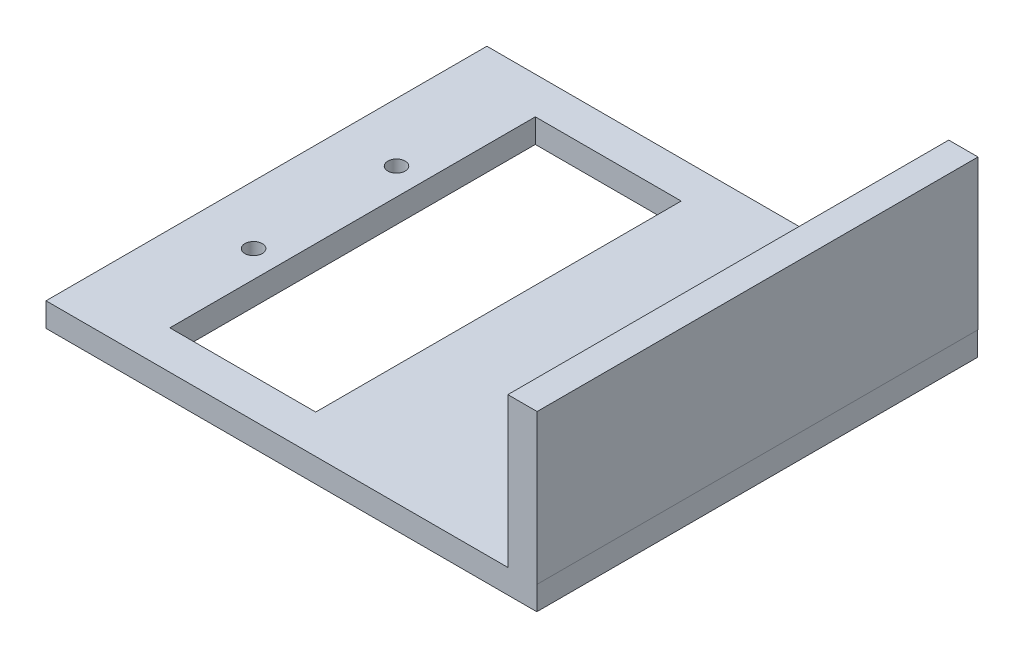
ISO-10303-21;
HEADER;
FILE_DESCRIPTION(('STEP AP214'),'2;1');
FILE_NAME('part.step','',(''),(''),'','','');
FILE_SCHEMA(('AUTOMOTIVE_DESIGN { 1 0 10303 214 1 1 1 1 }'));
ENDSEC;
DATA;
#1=APPLICATION_CONTEXT('core data for automotive mechanical design processes');
#2=APPLICATION_PROTOCOL_DEFINITION('international standard','automotive_design',2000,#1);
#3=PRODUCT_CONTEXT('',#1,'mechanical');
#4=PRODUCT('Part','Part','',(#3));
#5=PRODUCT_RELATED_PRODUCT_CATEGORY('part','',(#4));
#6=PRODUCT_DEFINITION_FORMATION('','',#4);
#7=PRODUCT_DEFINITION_CONTEXT('part definition',#1,'design');
#8=PRODUCT_DEFINITION('design','',#6,#7);
#9=PRODUCT_DEFINITION_SHAPE('','',#8);
#10=(LENGTH_UNIT() NAMED_UNIT(*) SI_UNIT(.MILLI.,.METRE.));
#11=(NAMED_UNIT(*) PLANE_ANGLE_UNIT() SI_UNIT($,.RADIAN.));
#12=(NAMED_UNIT(*) SI_UNIT($,.STERADIAN.) SOLID_ANGLE_UNIT());
#13=UNCERTAINTY_MEASURE_WITH_UNIT(LENGTH_MEASURE(1.E-05),#10,'distance_accuracy_value','');
#14=(GEOMETRIC_REPRESENTATION_CONTEXT(3) GLOBAL_UNCERTAINTY_ASSIGNED_CONTEXT((#13)) GLOBAL_UNIT_ASSIGNED_CONTEXT((#10,
#11,#12)) REPRESENTATION_CONTEXT('',''));
#15=CARTESIAN_POINT('',(0.,0.,0.));
#16=DIRECTION('',(0.,0.,1.));
#17=DIRECTION('',(1.,0.,0.));
#18=AXIS2_PLACEMENT_3D('',#15,#16,#17);
#19=CARTESIAN_POINT('',(-40.3323535464941,4.,-34.672058238389));
#20=DIRECTION('',(1.,0.,0.));
#21=DIRECTION('',(0.,0.,-1.));
#22=AXIS2_PLACEMENT_3D('',#19,#20,#21);
#23=PLANE('',#22);
#24=DIRECTION('',(0.,0.,1.));
#25=VECTOR('',#24,1.);
#26=CARTESIAN_POINT('',(-40.3323535464941,0.,-34.672058238389));
#27=LINE('',#26,#25);
#28=CARTESIAN_POINT('',(-40.3323535464941,0.,-34.672058238389));
#29=VERTEX_POINT('',#28);
#30=CARTESIAN_POINT('',(-40.3323535464941,0.,38.987941761611));
#31=VERTEX_POINT('',#30);
#32=EDGE_CURVE('E188',#29,#31,#27,.T.);
#33=ORIENTED_EDGE('',*,*,#32,.T.);
#34=DIRECTION('',(0.,-1.,0.));
#35=VECTOR('',#34,1.);
#36=CARTESIAN_POINT('',(-40.3323535464941,4.,38.987941761611));
#37=LINE('',#36,#35);
#38=CARTESIAN_POINT('',(-40.3323535464941,4.,38.987941761611));
#39=VERTEX_POINT('',#38);
#40=EDGE_CURVE('E216',#39,#31,#37,.T.);
#41=ORIENTED_EDGE('',*,*,#40,.F.);
#42=DIRECTION('',(0.,0.,1.));
#43=VECTOR('',#42,1.);
#44=CARTESIAN_POINT('',(-40.3323535464941,4.,-34.672058238389));
#45=LINE('',#44,#43);
#46=CARTESIAN_POINT('',(-40.3323535464941,4.,-34.672058238389));
#47=VERTEX_POINT('',#46);
#48=EDGE_CURVE('E189',#47,#39,#45,.T.);
#49=ORIENTED_EDGE('',*,*,#48,.F.);
#50=DIRECTION('',(0.,-1.,0.));
#51=VECTOR('',#50,1.);
#52=CARTESIAN_POINT('',(-40.3323535464941,4.,-34.672058238389));
#53=LINE('',#52,#51);
#54=EDGE_CURVE('E200',#47,#29,#53,.T.);
#55=ORIENTED_EDGE('',*,*,#54,.T.);
#56=EDGE_LOOP('',(#33,#41,#49,#55));
#57=FACE_BOUND('',#56,.T.);
#58=ADVANCED_FACE('F33',(#57),#23,.F.);
#59=CARTESIAN_POINT('',(-40.3323535464941,4.,38.987941761611));
#60=DIRECTION('',(0.,0.,-1.));
#61=DIRECTION('',(-1.,0.,0.));
#62=AXIS2_PLACEMENT_3D('',#59,#60,#61);
#63=PLANE('',#62);
#64=DIRECTION('',(1.,0.,0.));
#65=VECTOR('',#64,1.);
#66=CARTESIAN_POINT('',(-40.3323535464941,0.,38.987941761611));
#67=LINE('',#66,#65);
#68=CARTESIAN_POINT('',(41.6676464535059,0.,38.987941761611));
#69=VERTEX_POINT('',#68);
#70=EDGE_CURVE('E203',#31,#69,#67,.T.);
#71=ORIENTED_EDGE('',*,*,#70,.T.);
#72=DIRECTION('',(0.,-1.,0.));
#73=VECTOR('',#72,1.);
#74=CARTESIAN_POINT('',(41.6676464535059,4.,38.987941761611));
#75=LINE('',#74,#73);
#76=CARTESIAN_POINT('',(41.6676464535059,4.,38.987941761611));
#77=VERTEX_POINT('',#76);
#78=EDGE_CURVE('E213',#77,#69,#75,.T.);
#79=ORIENTED_EDGE('',*,*,#78,.F.);
#80=DIRECTION('',(1.,0.,0.));
#81=VECTOR('',#80,1.);
#82=CARTESIAN_POINT('',(36.8283216627106,4.,38.987941761611));
#83=LINE('',#82,#81);
#84=CARTESIAN_POINT('',(41.7155006134067,4.,38.987941761611));
#85=VERTEX_POINT('',#84);
#86=EDGE_CURVE('E171',#77,#85,#83,.T.);
#87=ORIENTED_EDGE('',*,*,#86,.T.);
#88=DIRECTION('',(0.,-1.,0.));
#89=VECTOR('',#88,1.);
#90=CARTESIAN_POINT('',(41.7155006134067,29.,38.987941761611));
#91=LINE('',#90,#89);
#92=CARTESIAN_POINT('',(41.7155006134067,29.,38.987941761611));
#93=VERTEX_POINT('',#92);
#94=EDGE_CURVE('E182',#93,#85,#91,.T.);
#95=ORIENTED_EDGE('',*,*,#94,.F.);
#96=DIRECTION('',(1.,0.,0.));
#97=VECTOR('',#96,1.);
#98=CARTESIAN_POINT('',(36.8283216627106,29.,38.987941761611));
#99=LINE('',#98,#97);
#100=CARTESIAN_POINT('',(36.8283216627106,29.,38.987941761611));
#101=VERTEX_POINT('',#100);
#102=EDGE_CURVE('E160',#101,#93,#99,.T.);
#103=ORIENTED_EDGE('',*,*,#102,.F.);
#104=DIRECTION('',(0.,-1.,0.));
#105=VECTOR('',#104,1.);
#106=CARTESIAN_POINT('',(36.8283216627106,29.,38.987941761611));
#107=LINE('',#106,#105);
#108=CARTESIAN_POINT('',(36.8283216627106,4.,38.987941761611));
#109=VERTEX_POINT('',#108);
#110=EDGE_CURVE('E185',#101,#109,#107,.T.);
#111=ORIENTED_EDGE('',*,*,#110,.T.);
#112=DIRECTION('',(1.,0.,0.));
#113=VECTOR('',#112,1.);
#114=CARTESIAN_POINT('',(-40.3323535464941,4.,38.987941761611));
#115=LINE('',#114,#113);
#116=EDGE_CURVE('E192',#39,#109,#115,.T.);
#117=ORIENTED_EDGE('',*,*,#116,.F.);
#118=ORIENTED_EDGE('',*,*,#40,.T.);
#119=EDGE_LOOP('',(#71,#79,#87,#95,#103,#111,#117,#118));
#120=FACE_BOUND('',#119,.T.);
#121=ADVANCED_FACE('F246',(#120),#63,.F.);
#122=CARTESIAN_POINT('',(41.6676464535059,4.,-34.672058238389));
#123=DIRECTION('',(-1.,0.,0.));
#124=DIRECTION('',(0.,0.,1.));
#125=AXIS2_PLACEMENT_3D('',#122,#123,#124);
#126=PLANE('',#125);
#127=DIRECTION('',(0.,0.,-1.));
#128=VECTOR('',#127,1.);
#129=CARTESIAN_POINT('',(41.6676464535059,0.,-34.672058238389));
#130=LINE('',#129,#128);
#131=CARTESIAN_POINT('',(41.6676464535059,0.,-34.672058238389));
#132=VERTEX_POINT('',#131);
#133=EDGE_CURVE('E205',#69,#132,#130,.T.);
#134=ORIENTED_EDGE('',*,*,#133,.T.);
#135=DIRECTION('',(0.,-1.,0.));
#136=VECTOR('',#135,1.);
#137=CARTESIAN_POINT('',(41.6676464535059,4.,-34.672058238389));
#138=LINE('',#137,#136);
#139=CARTESIAN_POINT('',(41.6676464535059,4.,-34.672058238389));
#140=VERTEX_POINT('',#139);
#141=EDGE_CURVE('E210',#140,#132,#138,.T.);
#142=ORIENTED_EDGE('',*,*,#141,.F.);
#143=DIRECTION('',(0.,0.,-1.));
#144=VECTOR('',#143,1.);
#145=CARTESIAN_POINT('',(41.6676464535059,4.,-34.672058238389));
#146=LINE('',#145,#144);
#147=EDGE_CURVE('E195',#77,#140,#146,.T.);
#148=ORIENTED_EDGE('',*,*,#147,.F.);
#149=ORIENTED_EDGE('',*,*,#78,.T.);
#150=EDGE_LOOP('',(#134,#142,#148,#149));
#151=FACE_BOUND('',#150,.T.);
#152=ADVANCED_FACE('F251',(#151),#126,.F.);
#153=CARTESIAN_POINT('',(-40.3323535464941,4.,-34.672058238389));
#154=DIRECTION('',(0.,0.,1.));
#155=DIRECTION('',(1.,0.,0.));
#156=AXIS2_PLACEMENT_3D('',#153,#154,#155);
#157=PLANE('',#156);
#158=DIRECTION('',(-1.,0.,0.));
#159=VECTOR('',#158,1.);
#160=CARTESIAN_POINT('',(-40.3323535464941,0.,-34.672058238389));
#161=LINE('',#160,#159);
#162=EDGE_CURVE('E193',#132,#29,#161,.T.);
#163=ORIENTED_EDGE('',*,*,#162,.T.);
#164=ORIENTED_EDGE('',*,*,#54,.F.);
#165=DIRECTION('',(-1.,0.,0.));
#166=VECTOR('',#165,1.);
#167=CARTESIAN_POINT('',(-40.3323535464941,4.,-34.672058238389));
#168=LINE('',#167,#166);
#169=CARTESIAN_POINT('',(36.8283216627106,4.,-34.672058238389));
#170=VERTEX_POINT('',#169);
#171=EDGE_CURVE('E198',#170,#47,#168,.T.);
#172=ORIENTED_EDGE('',*,*,#171,.F.);
#173=DIRECTION('',(0.,-1.,0.));
#174=VECTOR('',#173,1.);
#175=CARTESIAN_POINT('',(36.8283216627106,29.,-34.672058238389));
#176=LINE('',#175,#174);
#177=CARTESIAN_POINT('',(36.8283216627106,29.,-34.672058238389));
#178=VERTEX_POINT('',#177);
#179=EDGE_CURVE('E167',#178,#170,#176,.T.);
#180=ORIENTED_EDGE('',*,*,#179,.F.);
#181=DIRECTION('',(-1.,0.,0.));
#182=VECTOR('',#181,1.);
#183=CARTESIAN_POINT('',(36.8283216627106,29.,-34.672058238389));
#184=LINE('',#183,#182);
#185=CARTESIAN_POINT('',(41.7155006134067,29.,-34.672058238389));
#186=VERTEX_POINT('',#185);
#187=EDGE_CURVE('E165',#186,#178,#184,.T.);
#188=ORIENTED_EDGE('',*,*,#187,.F.);
#189=DIRECTION('',(0.,-1.,0.));
#190=VECTOR('',#189,1.);
#191=CARTESIAN_POINT('',(41.7155006134067,29.,-34.672058238389));
#192=LINE('',#191,#190);
#193=CARTESIAN_POINT('',(41.7155006134067,4.,-34.672058238389));
#194=VERTEX_POINT('',#193);
#195=EDGE_CURVE('E179',#186,#194,#192,.T.);
#196=ORIENTED_EDGE('',*,*,#195,.T.);
#197=DIRECTION('',(-1.,0.,0.));
#198=VECTOR('',#197,1.);
#199=CARTESIAN_POINT('',(36.8283216627106,4.,-34.672058238389));
#200=LINE('',#199,#198);
#201=EDGE_CURVE('E161',#194,#140,#200,.T.);
#202=ORIENTED_EDGE('',*,*,#201,.T.);
#203=ORIENTED_EDGE('',*,*,#141,.T.);
#204=EDGE_LOOP('',(#163,#164,#172,#180,#188,#196,#202,#203));
#205=FACE_BOUND('',#204,.T.);
#206=ADVANCED_FACE('F265',(#205),#157,.F.);
#207=CARTESIAN_POINT('',(0.,4.,0.));
#208=DIRECTION('',(0.,1.,0.));
#209=DIRECTION('',(0.,0.,1.));
#210=AXIS2_PLACEMENT_3D('',#207,#208,#209);
#211=PLANE('',#210);
#212=DIRECTION('',(0.,0.,-1.));
#213=VECTOR('',#212,1.);
#214=CARTESIAN_POINT('',(-1.70011262750802,4.,-28.5027211675137));
#215=LINE('',#214,#213);
#216=CARTESIAN_POINT('',(-1.70011262750802,4.,32.5599938993808));
#217=VERTEX_POINT('',#216);
#218=CARTESIAN_POINT('',(-1.70011262750802,4.,-28.5027211675137));
#219=VERTEX_POINT('',#218);
#220=EDGE_CURVE('E47',#217,#219,#215,.T.);
#221=ORIENTED_EDGE('',*,*,#220,.F.);
#222=DIRECTION('',(1.,0.,0.));
#223=VECTOR('',#222,1.);
#224=CARTESIAN_POINT('',(-1.70011262750802,4.,32.5599938993808));
#225=LINE('',#224,#223);
#226=CARTESIAN_POINT('',(-26.070112627508,4.,32.5599938993808));
#227=VERTEX_POINT('',#226);
#228=EDGE_CURVE('E140',#227,#217,#225,.T.);
#229=ORIENTED_EDGE('',*,*,#228,.F.);
#230=DIRECTION('',(0.,0.,1.));
#231=VECTOR('',#230,1.);
#232=CARTESIAN_POINT('',(-26.070112627508,4.,-28.5027211675137));
#233=LINE('',#232,#231);
#234=CARTESIAN_POINT('',(-26.070112627508,4.,-28.5027211675137));
#235=VERTEX_POINT('',#234);
#236=EDGE_CURVE('E124',#235,#227,#233,.T.);
#237=ORIENTED_EDGE('',*,*,#236,.F.);
#238=DIRECTION('',(-1.,0.,0.));
#239=VECTOR('',#238,1.);
#240=CARTESIAN_POINT('',(-1.70011262750802,4.,-28.5027211675137));
#241=LINE('',#240,#239);
#242=EDGE_CURVE('E133',#219,#235,#241,.T.);
#243=ORIENTED_EDGE('',*,*,#242,.F.);
#244=EDGE_LOOP('',(#221,#229,#237,#243));
#245=FACE_BOUND('',#244,.T.);
#246=CARTESIAN_POINT('',(-30.5440501475938,4.,14.097941761611));
#247=DIRECTION('',(0.,1.,0.));
#248=DIRECTION('',(0.,0.,1.));
#249=AXIS2_PLACEMENT_3D('',#246,#247,#248);
#250=CIRCLE('',#249,1.45);
#251=CARTESIAN_POINT('',(-30.5440501475938,4.,15.547941761611));
#252=VERTEX_POINT('',#251);
#253=EDGE_CURVE('E147',#252,#252,#250,.T.);
#254=ORIENTED_EDGE('',*,*,#253,.F.);
#255=EDGE_LOOP('',(#254));
#256=FACE_BOUND('',#255,.T.);
#257=CARTESIAN_POINT('',(-30.5440501475938,4.,-9.782058238389));
#258=DIRECTION('',(0.,1.,0.));
#259=DIRECTION('',(0.,0.,1.));
#260=AXIS2_PLACEMENT_3D('',#257,#258,#259);
#261=CIRCLE('',#260,1.45);
#262=CARTESIAN_POINT('',(-30.5440501475938,4.,-8.332058238389));
#263=VERTEX_POINT('',#262);
#264=EDGE_CURVE('E153',#263,#263,#261,.T.);
#265=ORIENTED_EDGE('',*,*,#264,.F.);
#266=EDGE_LOOP('',(#265));
#267=FACE_BOUND('',#266,.T.);
#268=DIRECTION('',(0.,0.,1.));
#269=VECTOR('',#268,1.);
#270=CARTESIAN_POINT('',(36.8283216627106,4.,-34.672058238389));
#271=LINE('',#270,#269);
#272=EDGE_CURVE('E168',#170,#109,#271,.T.);
#273=ORIENTED_EDGE('',*,*,#272,.F.);
#274=ORIENTED_EDGE('',*,*,#171,.T.);
#275=ORIENTED_EDGE('',*,*,#48,.T.);
#276=ORIENTED_EDGE('',*,*,#116,.T.);
#277=EDGE_LOOP('',(#273,#274,#275,#276));
#278=FACE_BOUND('',#277,.T.);
#279=ADVANCED_FACE('F137',(#245,#256,#267,#278),#211,.T.);
#280=CARTESIAN_POINT('',(0.,0.,0.));
#281=DIRECTION('',(0.,1.,0.));
#282=DIRECTION('',(0.,0.,1.));
#283=AXIS2_PLACEMENT_3D('',#280,#281,#282);
#284=PLANE('',#283);
#285=DIRECTION('',(1.,0.,0.));
#286=VECTOR('',#285,1.);
#287=CARTESIAN_POINT('',(0.,0.,32.5599938993808));
#288=LINE('',#287,#286);
#289=CARTESIAN_POINT('',(-26.070112627508,0.,32.5599938993808));
#290=VERTEX_POINT('',#289);
#291=CARTESIAN_POINT('',(-1.70011262750802,0.,32.5599938993808));
#292=VERTEX_POINT('',#291);
#293=EDGE_CURVE('E40',#290,#292,#288,.T.);
#294=ORIENTED_EDGE('',*,*,#293,.T.);
#295=DIRECTION('',(0.,0.,-1.));
#296=VECTOR('',#295,1.);
#297=CARTESIAN_POINT('',(-1.70011262750802,0.,0.));
#298=LINE('',#297,#296);
#299=CARTESIAN_POINT('',(-1.70011262750802,0.,-28.5027211675137));
#300=VERTEX_POINT('',#299);
#301=EDGE_CURVE('E11',#292,#300,#298,.T.);
#302=ORIENTED_EDGE('',*,*,#301,.T.);
#303=DIRECTION('',(-1.,0.,0.));
#304=VECTOR('',#303,1.);
#305=CARTESIAN_POINT('',(0.,0.,-28.5027211675137));
#306=LINE('',#305,#304);
#307=CARTESIAN_POINT('',(-26.070112627508,0.,-28.5027211675137));
#308=VERTEX_POINT('',#307);
#309=EDGE_CURVE('E219',#300,#308,#306,.T.);
#310=ORIENTED_EDGE('',*,*,#309,.T.);
#311=DIRECTION('',(0.,0.,1.));
#312=VECTOR('',#311,1.);
#313=CARTESIAN_POINT('',(-26.070112627508,0.,0.));
#314=LINE('',#313,#312);
#315=EDGE_CURVE('E127',#308,#290,#314,.T.);
#316=ORIENTED_EDGE('',*,*,#315,.T.);
#317=EDGE_LOOP('',(#294,#302,#310,#316));
#318=FACE_BOUND('',#317,.T.);
#319=CARTESIAN_POINT('',(-30.5440501475938,0.,14.097941761611));
#320=DIRECTION('',(0.,1.,0.));
#321=DIRECTION('',(0.,0.,1.));
#322=AXIS2_PLACEMENT_3D('',#319,#320,#321);
#323=CIRCLE('',#322,1.45);
#324=CARTESIAN_POINT('',(-30.5440501475938,0.,15.547941761611));
#325=VERTEX_POINT('',#324);
#326=EDGE_CURVE('E152',#325,#325,#323,.T.);
#327=ORIENTED_EDGE('',*,*,#326,.T.);
#328=EDGE_LOOP('',(#327));
#329=FACE_BOUND('',#328,.T.);
#330=CARTESIAN_POINT('',(-30.5440501475938,0.,-9.782058238389));
#331=DIRECTION('',(0.,1.,0.));
#332=DIRECTION('',(0.,0.,1.));
#333=AXIS2_PLACEMENT_3D('',#330,#331,#332);
#334=CIRCLE('',#333,1.45);
#335=CARTESIAN_POINT('',(-30.5440501475938,0.,-8.332058238389));
#336=VERTEX_POINT('',#335);
#337=EDGE_CURVE('E156',#336,#336,#334,.T.);
#338=ORIENTED_EDGE('',*,*,#337,.T.);
#339=EDGE_LOOP('',(#338));
#340=FACE_BOUND('',#339,.T.);
#341=ORIENTED_EDGE('',*,*,#32,.F.);
#342=ORIENTED_EDGE('',*,*,#162,.F.);
#343=ORIENTED_EDGE('',*,*,#133,.F.);
#344=ORIENTED_EDGE('',*,*,#70,.F.);
#345=EDGE_LOOP('',(#341,#342,#343,#344));
#346=FACE_BOUND('',#345,.T.);
#347=ADVANCED_FACE('F227',(#318,#329,#340,#346),#284,.F.);
#348=CARTESIAN_POINT('',(0.,4.,0.));
#349=DIRECTION('',(0.,1.,0.));
#350=DIRECTION('',(0.,0.,1.));
#351=AXIS2_PLACEMENT_3D('',#348,#349,#350);
#352=PLANE('',#351);
#353=ORIENTED_EDGE('',*,*,#86,.F.);
#354=ORIENTED_EDGE('',*,*,#147,.T.);
#355=ORIENTED_EDGE('',*,*,#201,.F.);
#356=DIRECTION('',(0.,0.,-1.));
#357=VECTOR('',#356,1.);
#358=CARTESIAN_POINT('',(41.7155006134067,4.,-34.672058238389));
#359=LINE('',#358,#357);
#360=EDGE_CURVE('E173',#85,#194,#359,.T.);
#361=ORIENTED_EDGE('',*,*,#360,.F.);
#362=EDGE_LOOP('',(#353,#354,#355,#361));
#363=FACE_BOUND('',#362,.T.);
#364=ADVANCED_FACE('F271',(#363),#352,.F.);
#365=CARTESIAN_POINT('',(36.8283216627106,29.,-34.672058238389));
#366=DIRECTION('',(1.,0.,0.));
#367=DIRECTION('',(0.,0.,-1.));
#368=AXIS2_PLACEMENT_3D('',#365,#366,#367);
#369=PLANE('',#368);
#370=ORIENTED_EDGE('',*,*,#272,.T.);
#371=ORIENTED_EDGE('',*,*,#110,.F.);
#372=DIRECTION('',(0.,0.,1.));
#373=VECTOR('',#372,1.);
#374=CARTESIAN_POINT('',(36.8283216627106,29.,-34.672058238389));
#375=LINE('',#374,#373);
#376=EDGE_CURVE('E157',#178,#101,#375,.T.);
#377=ORIENTED_EDGE('',*,*,#376,.F.);
#378=ORIENTED_EDGE('',*,*,#179,.T.);
#379=EDGE_LOOP('',(#370,#371,#377,#378));
#380=FACE_BOUND('',#379,.T.);
#381=ADVANCED_FACE('F283',(#380),#369,.F.);
#382=CARTESIAN_POINT('',(41.7155006134067,29.,-34.672058238389));
#383=DIRECTION('',(-1.,0.,0.));
#384=DIRECTION('',(0.,0.,1.));
#385=AXIS2_PLACEMENT_3D('',#382,#383,#384);
#386=PLANE('',#385);
#387=ORIENTED_EDGE('',*,*,#360,.T.);
#388=ORIENTED_EDGE('',*,*,#195,.F.);
#389=DIRECTION('',(0.,0.,-1.));
#390=VECTOR('',#389,1.);
#391=CARTESIAN_POINT('',(41.7155006134067,29.,-34.672058238389));
#392=LINE('',#391,#390);
#393=EDGE_CURVE('E163',#93,#186,#392,.T.);
#394=ORIENTED_EDGE('',*,*,#393,.F.);
#395=ORIENTED_EDGE('',*,*,#94,.T.);
#396=EDGE_LOOP('',(#387,#388,#394,#395));
#397=FACE_BOUND('',#396,.T.);
#398=ADVANCED_FACE('F276',(#397),#386,.F.);
#399=CARTESIAN_POINT('',(0.,29.,0.));
#400=DIRECTION('',(0.,1.,0.));
#401=DIRECTION('',(0.,0.,1.));
#402=AXIS2_PLACEMENT_3D('',#399,#400,#401);
#403=PLANE('',#402);
#404=ORIENTED_EDGE('',*,*,#376,.T.);
#405=ORIENTED_EDGE('',*,*,#102,.T.);
#406=ORIENTED_EDGE('',*,*,#393,.T.);
#407=ORIENTED_EDGE('',*,*,#187,.T.);
#408=EDGE_LOOP('',(#404,#405,#406,#407));
#409=FACE_BOUND('',#408,.T.);
#410=ADVANCED_FACE('F280',(#409),#403,.T.);
#411=CARTESIAN_POINT('',(-30.5440501475938,-6.,-9.782058238389));
#412=DIRECTION('',(0.,1.,0.));
#413=DIRECTION('',(0.,0.,1.));
#414=AXIS2_PLACEMENT_3D('',#411,#412,#413);
#415=CYLINDRICAL_SURFACE('',#414,1.45);
#416=ORIENTED_EDGE('',*,*,#264,.T.);
#417=EDGE_LOOP('',(#416));
#418=FACE_BOUND('',#417,.T.);
#419=ORIENTED_EDGE('',*,*,#337,.F.);
#420=EDGE_LOOP('',(#419));
#421=FACE_BOUND('',#420,.T.);
#422=ADVANCED_FACE('F241',(#418,#421),#415,.F.);
#423=CARTESIAN_POINT('',(-30.5440501475938,-6.,14.097941761611));
#424=DIRECTION('',(0.,1.,0.));
#425=DIRECTION('',(0.,0.,1.));
#426=AXIS2_PLACEMENT_3D('',#423,#424,#425);
#427=CYLINDRICAL_SURFACE('',#426,1.45);
#428=ORIENTED_EDGE('',*,*,#253,.T.);
#429=EDGE_LOOP('',(#428));
#430=FACE_BOUND('',#429,.T.);
#431=ORIENTED_EDGE('',*,*,#326,.F.);
#432=EDGE_LOOP('',(#431));
#433=FACE_BOUND('',#432,.T.);
#434=ADVANCED_FACE('F234',(#430,#433),#427,.F.);
#435=CARTESIAN_POINT('',(-1.70011262750802,-6.,-28.5027211675137));
#436=DIRECTION('',(1.,0.,0.));
#437=DIRECTION('',(0.,0.,-1.));
#438=AXIS2_PLACEMENT_3D('',#435,#436,#437);
#439=PLANE('',#438);
#440=DIRECTION('',(0.,1.,0.));
#441=VECTOR('',#440,1.);
#442=CARTESIAN_POINT('',(-1.70011262750802,-6.,32.5599938993808));
#443=LINE('',#442,#441);
#444=EDGE_CURVE('E145',#292,#217,#443,.T.);
#445=ORIENTED_EDGE('',*,*,#444,.T.);
#446=ORIENTED_EDGE('',*,*,#220,.T.);
#447=DIRECTION('',(0.,1.,0.));
#448=VECTOR('',#447,1.);
#449=CARTESIAN_POINT('',(-1.70011262750802,-6.,-28.5027211675137));
#450=LINE('',#449,#448);
#451=EDGE_CURVE('E130',#300,#219,#450,.T.);
#452=ORIENTED_EDGE('',*,*,#451,.F.);
#453=ORIENTED_EDGE('',*,*,#301,.F.);
#454=EDGE_LOOP('',(#445,#446,#452,#453));
#455=FACE_BOUND('',#454,.T.);
#456=ADVANCED_FACE('F232',(#455),#439,.F.);
#457=CARTESIAN_POINT('',(-1.70011262750802,-6.,32.5599938993808));
#458=DIRECTION('',(0.,0.,1.));
#459=DIRECTION('',(1.,0.,0.));
#460=AXIS2_PLACEMENT_3D('',#457,#458,#459);
#461=PLANE('',#460);
#462=DIRECTION('',(0.,1.,0.));
#463=VECTOR('',#462,1.);
#464=CARTESIAN_POINT('',(-26.070112627508,-6.,32.5599938993808));
#465=LINE('',#464,#463);
#466=EDGE_CURVE('E129',#290,#227,#465,.T.);
#467=ORIENTED_EDGE('',*,*,#466,.T.);
#468=ORIENTED_EDGE('',*,*,#228,.T.);
#469=ORIENTED_EDGE('',*,*,#444,.F.);
#470=ORIENTED_EDGE('',*,*,#293,.F.);
#471=EDGE_LOOP('',(#467,#468,#469,#470));
#472=FACE_BOUND('',#471,.T.);
#473=ADVANCED_FACE('F231',(#472),#461,.F.);
#474=CARTESIAN_POINT('',(-26.070112627508,-6.,-28.5027211675137));
#475=DIRECTION('',(-1.,0.,0.));
#476=DIRECTION('',(0.,0.,1.));
#477=AXIS2_PLACEMENT_3D('',#474,#475,#476);
#478=PLANE('',#477);
#479=DIRECTION('',(0.,1.,0.));
#480=VECTOR('',#479,1.);
#481=CARTESIAN_POINT('',(-26.070112627508,-6.,-28.5027211675137));
#482=LINE('',#481,#480);
#483=EDGE_CURVE('E55',#308,#235,#482,.T.);
#484=ORIENTED_EDGE('',*,*,#483,.T.);
#485=ORIENTED_EDGE('',*,*,#236,.T.);
#486=ORIENTED_EDGE('',*,*,#466,.F.);
#487=ORIENTED_EDGE('',*,*,#315,.F.);
#488=EDGE_LOOP('',(#484,#485,#486,#487));
#489=FACE_BOUND('',#488,.T.);
#490=ADVANCED_FACE('F121',(#489),#478,.F.);
#491=CARTESIAN_POINT('',(-1.70011262750802,-6.,-28.5027211675137));
#492=DIRECTION('',(0.,0.,-1.));
#493=DIRECTION('',(-1.,0.,0.));
#494=AXIS2_PLACEMENT_3D('',#491,#492,#493);
#495=PLANE('',#494);
#496=ORIENTED_EDGE('',*,*,#451,.T.);
#497=ORIENTED_EDGE('',*,*,#242,.T.);
#498=ORIENTED_EDGE('',*,*,#483,.F.);
#499=ORIENTED_EDGE('',*,*,#309,.F.);
#500=EDGE_LOOP('',(#496,#497,#498,#499));
#501=FACE_BOUND('',#500,.T.);
#502=ADVANCED_FACE('F134',(#501),#495,.F.);
#503=CLOSED_SHELL('',(#58,#121,#152,#206,#279,#347,#364,#381,#398,#410,#422,#434,#456,#473,#490,#502));
#504=MANIFOLD_SOLID_BREP('B2',#503);
#505=ADVANCED_BREP_SHAPE_REPRESENTATION('',(#18,#504),#14);
#506=SHAPE_DEFINITION_REPRESENTATION(#9,#505);
ENDSEC;
END-ISO-10303-21;
